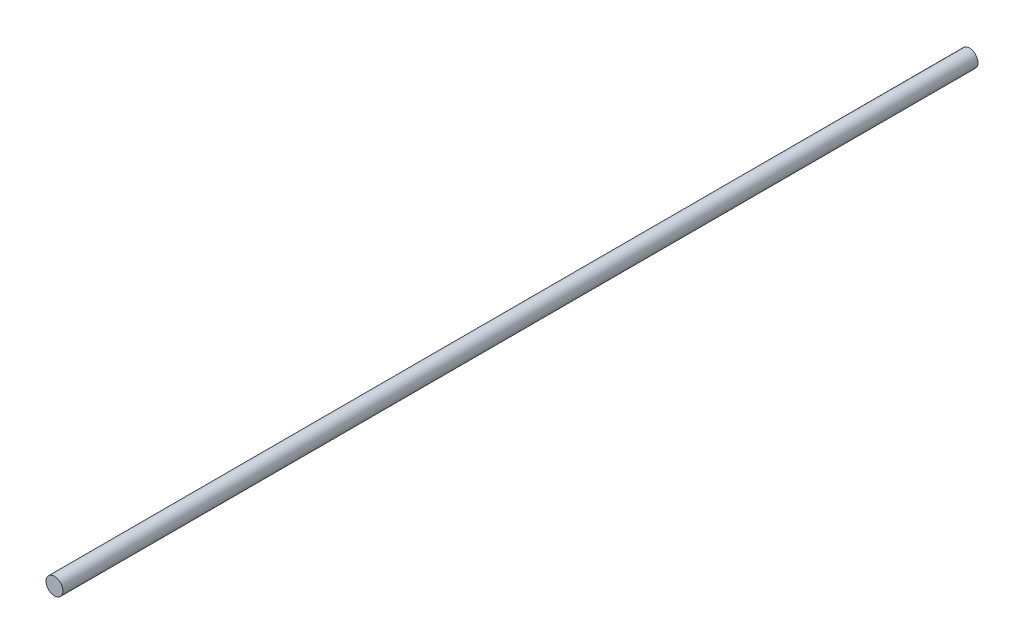
ISO-10303-21;
HEADER;
FILE_DESCRIPTION(('STEP AP214'),'2;1');
FILE_NAME('part.step','',(''),(''),'','','');
FILE_SCHEMA(('AUTOMOTIVE_DESIGN { 1 0 10303 214 1 1 1 1 }'));
ENDSEC;
DATA;
#1=APPLICATION_CONTEXT('core data for automotive mechanical design processes');
#2=APPLICATION_PROTOCOL_DEFINITION('international standard','automotive_design',2000,#1);
#3=PRODUCT_CONTEXT('',#1,'mechanical');
#4=PRODUCT('Part','Part','',(#3));
#5=PRODUCT_RELATED_PRODUCT_CATEGORY('part','',(#4));
#6=PRODUCT_DEFINITION_FORMATION('','',#4);
#7=PRODUCT_DEFINITION_CONTEXT('part definition',#1,'design');
#8=PRODUCT_DEFINITION('design','',#6,#7);
#9=PRODUCT_DEFINITION_SHAPE('','',#8);
#10=(LENGTH_UNIT() NAMED_UNIT(*) SI_UNIT(.MILLI.,.METRE.));
#11=(NAMED_UNIT(*) PLANE_ANGLE_UNIT() SI_UNIT($,.RADIAN.));
#12=(NAMED_UNIT(*) SI_UNIT($,.STERADIAN.) SOLID_ANGLE_UNIT());
#13=UNCERTAINTY_MEASURE_WITH_UNIT(LENGTH_MEASURE(1.E-05),#10,'distance_accuracy_value','');
#14=(GEOMETRIC_REPRESENTATION_CONTEXT(3) GLOBAL_UNCERTAINTY_ASSIGNED_CONTEXT((#13)) GLOBAL_UNIT_ASSIGNED_CONTEXT((#10,
#11,#12)) REPRESENTATION_CONTEXT('',''));
#15=CARTESIAN_POINT('',(0.,0.,0.));
#16=DIRECTION('',(0.,0.,1.));
#17=DIRECTION('',(1.,0.,0.));
#18=AXIS2_PLACEMENT_3D('',#15,#16,#17);
#19=CARTESIAN_POINT('',(0.,0.,-215.5));
#20=DIRECTION('',(0.,0.,1.));
#21=DIRECTION('',(1.,0.,0.));
#22=AXIS2_PLACEMENT_3D('',#19,#20,#21);
#23=CYLINDRICAL_SURFACE('',#22,4.);
#24=CARTESIAN_POINT('',(0.,0.,-215.5));
#25=DIRECTION('',(0.,0.,1.));
#26=DIRECTION('',(1.,0.,0.));
#27=AXIS2_PLACEMENT_3D('',#24,#25,#26);
#28=CIRCLE('',#27,4.);
#29=CARTESIAN_POINT('',(4.,0.,-215.5));
#30=VERTEX_POINT('',#29);
#31=EDGE_CURVE('E10',#30,#30,#28,.T.);
#32=ORIENTED_EDGE('',*,*,#31,.T.);
#33=EDGE_LOOP('',(#32));
#34=FACE_BOUND('',#33,.T.);
#35=CARTESIAN_POINT('',(0.,0.,215.5));
#36=DIRECTION('',(0.,0.,1.));
#37=DIRECTION('',(1.,0.,0.));
#38=AXIS2_PLACEMENT_3D('',#35,#36,#37);
#39=CIRCLE('',#38,4.);
#40=CARTESIAN_POINT('',(4.,0.,215.5));
#41=VERTEX_POINT('',#40);
#42=EDGE_CURVE('E35',#41,#41,#39,.T.);
#43=ORIENTED_EDGE('',*,*,#42,.F.);
#44=EDGE_LOOP('',(#43));
#45=FACE_BOUND('',#44,.T.);
#46=ADVANCED_FACE('F29',(#34,#45),#23,.T.);
#47=CARTESIAN_POINT('',(0.,0.,-215.5));
#48=DIRECTION('',(0.,0.,1.));
#49=DIRECTION('',(1.,0.,0.));
#50=AXIS2_PLACEMENT_3D('',#47,#48,#49);
#51=PLANE('',#50);
#52=ORIENTED_EDGE('',*,*,#31,.F.);
#53=EDGE_LOOP('',(#52));
#54=FACE_BOUND('',#53,.T.);
#55=ADVANCED_FACE('F44',(#54),#51,.F.);
#56=CARTESIAN_POINT('',(0.,0.,215.5));
#57=DIRECTION('',(0.,0.,1.));
#58=DIRECTION('',(1.,0.,0.));
#59=AXIS2_PLACEMENT_3D('',#56,#57,#58);
#60=PLANE('',#59);
#61=ORIENTED_EDGE('',*,*,#42,.T.);
#62=EDGE_LOOP('',(#61));
#63=FACE_BOUND('',#62,.T.);
#64=ADVANCED_FACE('F41',(#63),#60,.T.);
#65=CLOSED_SHELL('',(#46,#55,#64));
#66=MANIFOLD_SOLID_BREP('B2',#65);
#67=ADVANCED_BREP_SHAPE_REPRESENTATION('',(#18,#66),#14);
#68=SHAPE_DEFINITION_REPRESENTATION(#9,#67);
ENDSEC;
END-ISO-10303-21;
